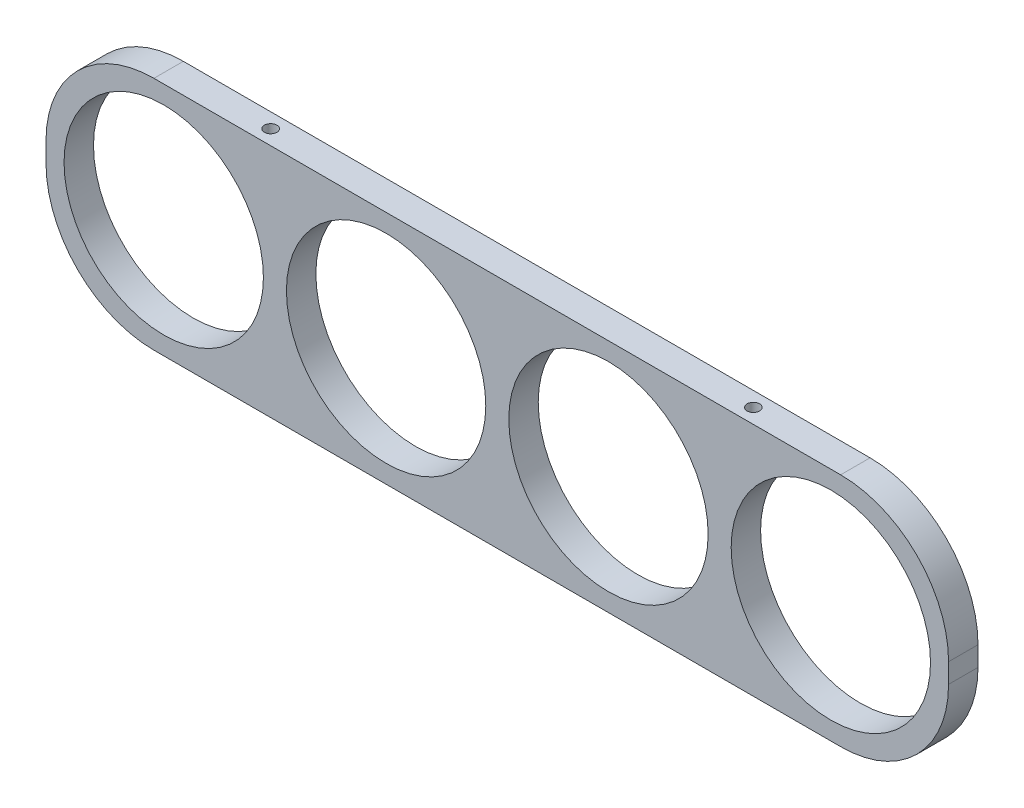
ISO-10303-21;
HEADER;
FILE_DESCRIPTION(('STEP AP214'),'2;1');
FILE_NAME('part.step','',(''),(''),'','','');
FILE_SCHEMA(('AUTOMOTIVE_DESIGN { 1 0 10303 214 1 1 1 1 }'));
ENDSEC;
DATA;
#1=APPLICATION_CONTEXT('core data for automotive mechanical design processes');
#2=APPLICATION_PROTOCOL_DEFINITION('international standard','automotive_design',2000,#1);
#3=PRODUCT_CONTEXT('',#1,'mechanical');
#4=PRODUCT('Part','Part','',(#3));
#5=PRODUCT_RELATED_PRODUCT_CATEGORY('part','',(#4));
#6=PRODUCT_DEFINITION_FORMATION('','',#4);
#7=PRODUCT_DEFINITION_CONTEXT('part definition',#1,'design');
#8=PRODUCT_DEFINITION('design','',#6,#7);
#9=PRODUCT_DEFINITION_SHAPE('','',#8);
#10=(LENGTH_UNIT() NAMED_UNIT(*) SI_UNIT(.MILLI.,.METRE.));
#11=(NAMED_UNIT(*) PLANE_ANGLE_UNIT() SI_UNIT($,.RADIAN.));
#12=(NAMED_UNIT(*) SI_UNIT($,.STERADIAN.) SOLID_ANGLE_UNIT());
#13=UNCERTAINTY_MEASURE_WITH_UNIT(LENGTH_MEASURE(1.E-05),#10,'distance_accuracy_value','');
#14=(GEOMETRIC_REPRESENTATION_CONTEXT(3) GLOBAL_UNCERTAINTY_ASSIGNED_CONTEXT((#13)) GLOBAL_UNIT_ASSIGNED_CONTEXT((#10,
#11,#12)) REPRESENTATION_CONTEXT('',''));
#15=CARTESIAN_POINT('',(0.,0.,0.));
#16=DIRECTION('',(0.,0.,1.));
#17=DIRECTION('',(1.,0.,0.));
#18=AXIS2_PLACEMENT_3D('',#15,#16,#17);
#19=CARTESIAN_POINT('',(-146.05,38.1,4.7625));
#20=DIRECTION('',(1.,0.,0.));
#21=DIRECTION('',(0.,0.,-1.));
#22=AXIS2_PLACEMENT_3D('',#19,#20,#21);
#23=PLANE('',#22);
#24=DIRECTION('',(0.,-1.,0.));
#25=VECTOR('',#24,1.);
#26=CARTESIAN_POINT('',(-146.05,38.1,4.7625));
#27=LINE('',#26,#25);
#28=CARTESIAN_POINT('',(-146.05,3.175,4.7625));
#29=VERTEX_POINT('',#28);
#30=CARTESIAN_POINT('',(-146.05,-3.17500000000001,4.7625));
#31=VERTEX_POINT('',#30);
#32=EDGE_CURVE('E164',#29,#31,#27,.T.);
#33=ORIENTED_EDGE('',*,*,#32,.F.);
#34=DIRECTION('',(0.,0.,-1.));
#35=VECTOR('',#34,1.);
#36=CARTESIAN_POINT('',(-146.05,3.17499999999999,4.7625));
#37=LINE('',#36,#35);
#38=CARTESIAN_POINT('',(-146.05,3.175,-4.7625));
#39=VERTEX_POINT('',#38);
#40=EDGE_CURVE('E190',#29,#39,#37,.T.);
#41=ORIENTED_EDGE('',*,*,#40,.T.);
#42=DIRECTION('',(0.,-1.,0.));
#43=VECTOR('',#42,1.);
#44=CARTESIAN_POINT('',(-146.05,38.1,-4.7625));
#45=LINE('',#44,#43);
#46=CARTESIAN_POINT('',(-146.05,-3.17500000000001,-4.7625));
#47=VERTEX_POINT('',#46);
#48=EDGE_CURVE('E140',#39,#47,#45,.T.);
#49=ORIENTED_EDGE('',*,*,#48,.T.);
#50=DIRECTION('',(0.,0.,-1.));
#51=VECTOR('',#50,1.);
#52=CARTESIAN_POINT('',(-146.05,-3.17500000000003,4.7625));
#53=LINE('',#52,#51);
#54=EDGE_CURVE('E177',#47,#31,#53,.F.);
#55=ORIENTED_EDGE('',*,*,#54,.T.);
#56=EDGE_LOOP('',(#33,#41,#49,#55));
#57=FACE_BOUND('',#56,.T.);
#58=ADVANCED_FACE('F42',(#57),#23,.F.);
#59=CARTESIAN_POINT('',(146.05,-38.1,4.7625));
#60=DIRECTION('',(0.,1.,0.));
#61=DIRECTION('',(-1.,0.,0.));
#62=AXIS2_PLACEMENT_3D('',#59,#60,#61);
#63=PLANE('',#62);
#64=DIRECTION('',(1.,0.,0.));
#65=VECTOR('',#64,1.);
#66=CARTESIAN_POINT('',(146.05,-38.1,-4.7625));
#67=LINE('',#66,#65);
#68=CARTESIAN_POINT('',(-111.125,-38.1,-4.7625));
#69=VERTEX_POINT('',#68);
#70=CARTESIAN_POINT('',(111.125,-38.1,-4.7625));
#71=VERTEX_POINT('',#70);
#72=EDGE_CURVE('E180',#69,#71,#67,.T.);
#73=ORIENTED_EDGE('',*,*,#72,.T.);
#74=DIRECTION('',(0.,0.,-1.));
#75=VECTOR('',#74,1.);
#76=CARTESIAN_POINT('',(111.125,-38.1,4.7625));
#77=LINE('',#76,#75);
#78=CARTESIAN_POINT('',(111.125,-38.1,4.7625));
#79=VERTEX_POINT('',#78);
#80=EDGE_CURVE('E11',#71,#79,#77,.F.);
#81=ORIENTED_EDGE('',*,*,#80,.T.);
#82=DIRECTION('',(1.,0.,0.));
#83=VECTOR('',#82,1.);
#84=CARTESIAN_POINT('',(146.05,-38.1,4.7625));
#85=LINE('',#84,#83);
#86=CARTESIAN_POINT('',(-111.125,-38.1,4.7625));
#87=VERTEX_POINT('',#86);
#88=EDGE_CURVE('E167',#87,#79,#85,.T.);
#89=ORIENTED_EDGE('',*,*,#88,.F.);
#90=DIRECTION('',(0.,0.,-1.));
#91=VECTOR('',#90,1.);
#92=CARTESIAN_POINT('',(-111.125,-38.1,4.7625));
#93=LINE('',#92,#91);
#94=EDGE_CURVE('E50',#87,#69,#93,.T.);
#95=ORIENTED_EDGE('',*,*,#94,.T.);
#96=EDGE_LOOP('',(#73,#81,#89,#95));
#97=FACE_BOUND('',#96,.T.);
#98=ADVANCED_FACE('F223',(#97),#63,.F.);
#99=CARTESIAN_POINT('',(146.05,38.1,4.7625));
#100=DIRECTION('',(-1.,0.,0.));
#101=DIRECTION('',(0.,0.,1.));
#102=AXIS2_PLACEMENT_3D('',#99,#100,#101);
#103=PLANE('',#102);
#104=DIRECTION('',(0.,1.,0.));
#105=VECTOR('',#104,1.);
#106=CARTESIAN_POINT('',(146.05,38.1,4.7625));
#107=LINE('',#106,#105);
#108=CARTESIAN_POINT('',(146.05,-3.17499999999999,4.7625));
#109=VERTEX_POINT('',#108);
#110=CARTESIAN_POINT('',(146.05,3.17500000000003,4.7625));
#111=VERTEX_POINT('',#110);
#112=EDGE_CURVE('E171',#109,#111,#107,.T.);
#113=ORIENTED_EDGE('',*,*,#112,.F.);
#114=DIRECTION('',(0.,0.,-1.));
#115=VECTOR('',#114,1.);
#116=CARTESIAN_POINT('',(146.05,-3.175,4.7625));
#117=LINE('',#116,#115);
#118=CARTESIAN_POINT('',(146.05,-3.17499999999999,-4.7625));
#119=VERTEX_POINT('',#118);
#120=EDGE_CURVE('E216',#109,#119,#117,.T.);
#121=ORIENTED_EDGE('',*,*,#120,.T.);
#122=DIRECTION('',(0.,1.,0.));
#123=VECTOR('',#122,1.);
#124=CARTESIAN_POINT('',(146.05,38.1,-4.7625));
#125=LINE('',#124,#123);
#126=CARTESIAN_POINT('',(146.05,3.17500000000003,-4.7625));
#127=VERTEX_POINT('',#126);
#128=EDGE_CURVE('E184',#119,#127,#125,.T.);
#129=ORIENTED_EDGE('',*,*,#128,.T.);
#130=DIRECTION('',(0.,0.,-1.));
#131=VECTOR('',#130,1.);
#132=CARTESIAN_POINT('',(146.05,3.17500000000001,4.7625));
#133=LINE('',#132,#131);
#134=EDGE_CURVE('E57',#127,#111,#133,.F.);
#135=ORIENTED_EDGE('',*,*,#134,.T.);
#136=EDGE_LOOP('',(#113,#121,#129,#135));
#137=FACE_BOUND('',#136,.T.);
#138=ADVANCED_FACE('F234',(#137),#103,.F.);
#139=CARTESIAN_POINT('',(146.05,38.1,4.7625));
#140=DIRECTION('',(0.,-1.,0.));
#141=DIRECTION('',(1.,0.,0.));
#142=AXIS2_PLACEMENT_3D('',#139,#140,#141);
#143=PLANE('',#142);
#144=CARTESIAN_POINT('',(-78.105,38.1,0.));
#145=DIRECTION('',(0.,1.,0.));
#146=DIRECTION('',(0.,0.,1.));
#147=AXIS2_PLACEMENT_3D('',#144,#145,#146);
#148=CIRCLE('',#147,2.01929999999999);
#149=CARTESIAN_POINT('',(-78.105,38.1,2.01929999999999));
#150=VERTEX_POINT('',#149);
#151=EDGE_CURVE('E124',#150,#150,#148,.T.);
#152=ORIENTED_EDGE('',*,*,#151,.F.);
#153=EDGE_LOOP('',(#152));
#154=FACE_BOUND('',#153,.T.);
#155=CARTESIAN_POINT('',(78.105,38.1,0.));
#156=DIRECTION('',(0.,1.,0.));
#157=DIRECTION('',(0.,0.,1.));
#158=AXIS2_PLACEMENT_3D('',#155,#156,#157);
#159=CIRCLE('',#158,2.01929999999999);
#160=CARTESIAN_POINT('',(78.105,38.1,2.01929999999999));
#161=VERTEX_POINT('',#160);
#162=EDGE_CURVE('E123',#161,#161,#159,.T.);
#163=ORIENTED_EDGE('',*,*,#162,.F.);
#164=EDGE_LOOP('',(#163));
#165=FACE_BOUND('',#164,.T.);
#166=DIRECTION('',(-1.,0.,0.));
#167=VECTOR('',#166,1.);
#168=CARTESIAN_POINT('',(146.05,38.1,-4.7625));
#169=LINE('',#168,#167);
#170=CARTESIAN_POINT('',(111.125,38.1,-4.7625));
#171=VERTEX_POINT('',#170);
#172=CARTESIAN_POINT('',(-111.125,38.1,-4.7625));
#173=VERTEX_POINT('',#172);
#174=EDGE_CURVE('E168',#171,#173,#169,.T.);
#175=ORIENTED_EDGE('',*,*,#174,.T.);
#176=DIRECTION('',(0.,0.,-1.));
#177=VECTOR('',#176,1.);
#178=CARTESIAN_POINT('',(-111.125,38.1,4.7625));
#179=LINE('',#178,#177);
#180=CARTESIAN_POINT('',(-111.125,38.1,4.7625));
#181=VERTEX_POINT('',#180);
#182=EDGE_CURVE('E205',#173,#181,#179,.F.);
#183=ORIENTED_EDGE('',*,*,#182,.T.);
#184=DIRECTION('',(-1.,0.,0.));
#185=VECTOR('',#184,1.);
#186=CARTESIAN_POINT('',(146.05,38.1,4.7625));
#187=LINE('',#186,#185);
#188=CARTESIAN_POINT('',(111.125,38.1,4.7625));
#189=VERTEX_POINT('',#188);
#190=EDGE_CURVE('E173',#189,#181,#187,.T.);
#191=ORIENTED_EDGE('',*,*,#190,.F.);
#192=DIRECTION('',(0.,0.,-1.));
#193=VECTOR('',#192,1.);
#194=CARTESIAN_POINT('',(111.125,38.1,4.7625));
#195=LINE('',#194,#193);
#196=EDGE_CURVE('E202',#189,#171,#195,.T.);
#197=ORIENTED_EDGE('',*,*,#196,.T.);
#198=EDGE_LOOP('',(#175,#183,#191,#197));
#199=FACE_BOUND('',#198,.T.);
#200=ADVANCED_FACE('F242',(#154,#165,#199),#143,.F.);
#201=CARTESIAN_POINT('',(0.,0.,4.7625));
#202=DIRECTION('',(0.,0.,-1.));
#203=DIRECTION('',(-1.,0.,0.));
#204=AXIS2_PLACEMENT_3D('',#201,#202,#203);
#205=PLANE('',#204);
#206=CARTESIAN_POINT('',(-107.95,0.,4.7625));
#207=DIRECTION('',(0.,0.,1.));
#208=DIRECTION('',(1.,0.,0.));
#209=AXIS2_PLACEMENT_3D('',#206,#207,#208);
#210=CIRCLE('',#209,32.258);
#211=CARTESIAN_POINT('',(-75.692,0.,4.7625));
#212=VERTEX_POINT('',#211);
#213=EDGE_CURVE('E141',#212,#212,#210,.T.);
#214=ORIENTED_EDGE('',*,*,#213,.F.);
#215=EDGE_LOOP('',(#214));
#216=FACE_BOUND('',#215,.T.);
#217=CARTESIAN_POINT('',(-35.9833333333333,0.,4.7625));
#218=DIRECTION('',(0.,0.,1.));
#219=DIRECTION('',(1.,0.,0.));
#220=AXIS2_PLACEMENT_3D('',#217,#218,#219);
#221=CIRCLE('',#220,32.258);
#222=CARTESIAN_POINT('',(-3.72533333333334,0.,4.7625));
#223=VERTEX_POINT('',#222);
#224=EDGE_CURVE('E149',#223,#223,#221,.T.);
#225=ORIENTED_EDGE('',*,*,#224,.F.);
#226=EDGE_LOOP('',(#225));
#227=FACE_BOUND('',#226,.T.);
#228=CARTESIAN_POINT('',(35.9833333333333,0.,4.7625));
#229=DIRECTION('',(0.,0.,1.));
#230=DIRECTION('',(1.,0.,0.));
#231=AXIS2_PLACEMENT_3D('',#228,#229,#230);
#232=CIRCLE('',#231,32.258);
#233=CARTESIAN_POINT('',(68.2413333333333,0.,4.7625));
#234=VERTEX_POINT('',#233);
#235=EDGE_CURVE('E156',#234,#234,#232,.T.);
#236=ORIENTED_EDGE('',*,*,#235,.F.);
#237=EDGE_LOOP('',(#236));
#238=FACE_BOUND('',#237,.T.);
#239=CARTESIAN_POINT('',(107.95,0.,4.7625));
#240=DIRECTION('',(0.,0.,1.));
#241=DIRECTION('',(1.,0.,0.));
#242=AXIS2_PLACEMENT_3D('',#239,#240,#241);
#243=CIRCLE('',#242,32.258);
#244=CARTESIAN_POINT('',(140.208,0.,4.7625));
#245=VERTEX_POINT('',#244);
#246=EDGE_CURVE('E135',#245,#245,#243,.T.);
#247=ORIENTED_EDGE('',*,*,#246,.F.);
#248=EDGE_LOOP('',(#247));
#249=FACE_BOUND('',#248,.T.);
#250=ORIENTED_EDGE('',*,*,#190,.T.);
#251=CARTESIAN_POINT('',(-111.125,3.17499999999999,4.7625));
#252=DIRECTION('',(0.,0.,-1.));
#253=DIRECTION('',(-1.,0.,0.));
#254=AXIS2_PLACEMENT_3D('',#251,#252,#253);
#255=CIRCLE('',#254,34.925);
#256=EDGE_CURVE('E213',#181,#29,#255,.F.);
#257=ORIENTED_EDGE('',*,*,#256,.T.);
#258=ORIENTED_EDGE('',*,*,#32,.T.);
#259=CARTESIAN_POINT('',(-111.125,-3.17500000000003,4.7625));
#260=DIRECTION('',(0.,0.,-1.));
#261=DIRECTION('',(-1.,0.,0.));
#262=AXIS2_PLACEMENT_3D('',#259,#260,#261);
#263=CIRCLE('',#262,34.925);
#264=EDGE_CURVE('E210',#31,#87,#263,.F.);
#265=ORIENTED_EDGE('',*,*,#264,.T.);
#266=ORIENTED_EDGE('',*,*,#88,.T.);
#267=CARTESIAN_POINT('',(111.125,-3.175,4.7625));
#268=DIRECTION('',(0.,0.,-1.));
#269=DIRECTION('',(-1.,0.,0.));
#270=AXIS2_PLACEMENT_3D('',#267,#268,#269);
#271=CIRCLE('',#270,34.925);
#272=EDGE_CURVE('E64',#79,#109,#271,.F.);
#273=ORIENTED_EDGE('',*,*,#272,.T.);
#274=ORIENTED_EDGE('',*,*,#112,.T.);
#275=CARTESIAN_POINT('',(111.125,3.17500000000001,4.7625));
#276=DIRECTION('',(0.,0.,-1.));
#277=DIRECTION('',(-1.,0.,0.));
#278=AXIS2_PLACEMENT_3D('',#275,#276,#277);
#279=CIRCLE('',#278,34.925);
#280=EDGE_CURVE('E208',#111,#189,#279,.F.);
#281=ORIENTED_EDGE('',*,*,#280,.T.);
#282=EDGE_LOOP('',(#250,#257,#258,#265,#266,#273,#274,#281));
#283=FACE_BOUND('',#282,.T.);
#284=ADVANCED_FACE('F236',(#216,#227,#238,#249,#283),#205,.F.);
#285=CARTESIAN_POINT('',(0.,0.,-4.7625));
#286=DIRECTION('',(0.,0.,-1.));
#287=DIRECTION('',(-1.,0.,0.));
#288=AXIS2_PLACEMENT_3D('',#285,#286,#287);
#289=PLANE('',#288);
#290=CARTESIAN_POINT('',(-107.95,0.,-4.7625));
#291=DIRECTION('',(0.,0.,1.));
#292=DIRECTION('',(1.,0.,0.));
#293=AXIS2_PLACEMENT_3D('',#290,#291,#292);
#294=CIRCLE('',#293,32.258);
#295=CARTESIAN_POINT('',(-75.692,0.,-4.7625));
#296=VERTEX_POINT('',#295);
#297=EDGE_CURVE('E136',#296,#296,#294,.T.);
#298=ORIENTED_EDGE('',*,*,#297,.T.);
#299=EDGE_LOOP('',(#298));
#300=FACE_BOUND('',#299,.T.);
#301=CARTESIAN_POINT('',(-35.9833333333333,0.,-4.7625));
#302=DIRECTION('',(0.,0.,1.));
#303=DIRECTION('',(1.,0.,0.));
#304=AXIS2_PLACEMENT_3D('',#301,#302,#303);
#305=CIRCLE('',#304,32.258);
#306=CARTESIAN_POINT('',(-3.72533333333334,0.,-4.7625));
#307=VERTEX_POINT('',#306);
#308=EDGE_CURVE('E145',#307,#307,#305,.T.);
#309=ORIENTED_EDGE('',*,*,#308,.T.);
#310=EDGE_LOOP('',(#309));
#311=FACE_BOUND('',#310,.T.);
#312=CARTESIAN_POINT('',(35.9833333333333,0.,-4.7625));
#313=DIRECTION('',(0.,0.,1.));
#314=DIRECTION('',(1.,0.,0.));
#315=AXIS2_PLACEMENT_3D('',#312,#313,#314);
#316=CIRCLE('',#315,32.258);
#317=CARTESIAN_POINT('',(68.2413333333333,0.,-4.7625));
#318=VERTEX_POINT('',#317);
#319=EDGE_CURVE('E153',#318,#318,#316,.T.);
#320=ORIENTED_EDGE('',*,*,#319,.T.);
#321=EDGE_LOOP('',(#320));
#322=FACE_BOUND('',#321,.T.);
#323=CARTESIAN_POINT('',(107.95,0.,-4.7625));
#324=DIRECTION('',(0.,0.,1.));
#325=DIRECTION('',(1.,0.,0.));
#326=AXIS2_PLACEMENT_3D('',#323,#324,#325);
#327=CIRCLE('',#326,32.258);
#328=CARTESIAN_POINT('',(140.208,0.,-4.7625));
#329=VERTEX_POINT('',#328);
#330=EDGE_CURVE('E159',#329,#329,#327,.T.);
#331=ORIENTED_EDGE('',*,*,#330,.T.);
#332=EDGE_LOOP('',(#331));
#333=FACE_BOUND('',#332,.T.);
#334=ORIENTED_EDGE('',*,*,#48,.F.);
#335=CARTESIAN_POINT('',(-111.125,3.17499999999999,-4.7625));
#336=DIRECTION('',(0.,0.,-1.));
#337=DIRECTION('',(-1.,0.,0.));
#338=AXIS2_PLACEMENT_3D('',#335,#336,#337);
#339=CIRCLE('',#338,34.925);
#340=EDGE_CURVE('E199',#39,#173,#339,.T.);
#341=ORIENTED_EDGE('',*,*,#340,.T.);
#342=ORIENTED_EDGE('',*,*,#174,.F.);
#343=CARTESIAN_POINT('',(111.125,3.17500000000001,-4.7625));
#344=DIRECTION('',(0.,0.,-1.));
#345=DIRECTION('',(-1.,0.,0.));
#346=AXIS2_PLACEMENT_3D('',#343,#344,#345);
#347=CIRCLE('',#346,34.925);
#348=EDGE_CURVE('E193',#171,#127,#347,.T.);
#349=ORIENTED_EDGE('',*,*,#348,.T.);
#350=ORIENTED_EDGE('',*,*,#128,.F.);
#351=CARTESIAN_POINT('',(111.125,-3.175,-4.7625));
#352=DIRECTION('',(0.,0.,-1.));
#353=DIRECTION('',(-1.,0.,0.));
#354=AXIS2_PLACEMENT_3D('',#351,#352,#353);
#355=CIRCLE('',#354,34.925);
#356=EDGE_CURVE('E197',#119,#71,#355,.T.);
#357=ORIENTED_EDGE('',*,*,#356,.T.);
#358=ORIENTED_EDGE('',*,*,#72,.F.);
#359=CARTESIAN_POINT('',(-111.125,-3.17500000000003,-4.7625));
#360=DIRECTION('',(0.,0.,-1.));
#361=DIRECTION('',(-1.,0.,0.));
#362=AXIS2_PLACEMENT_3D('',#359,#360,#361);
#363=CIRCLE('',#362,34.925);
#364=EDGE_CURVE('E195',#69,#47,#363,.T.);
#365=ORIENTED_EDGE('',*,*,#364,.T.);
#366=EDGE_LOOP('',(#334,#341,#342,#349,#350,#357,#358,#365));
#367=FACE_BOUND('',#366,.T.);
#368=ADVANCED_FACE('F229',(#300,#311,#322,#333,#367),#289,.T.);
#369=CARTESIAN_POINT('',(107.95,0.,-4.7625));
#370=DIRECTION('',(0.,0.,1.));
#371=DIRECTION('',(1.,0.,0.));
#372=AXIS2_PLACEMENT_3D('',#369,#370,#371);
#373=CYLINDRICAL_SURFACE('',#372,32.258);
#374=ORIENTED_EDGE('',*,*,#330,.F.);
#375=EDGE_LOOP('',(#374));
#376=FACE_BOUND('',#375,.T.);
#377=ORIENTED_EDGE('',*,*,#246,.T.);
#378=EDGE_LOOP('',(#377));
#379=FACE_BOUND('',#378,.T.);
#380=ADVANCED_FACE('F288',(#376,#379),#373,.F.);
#381=CARTESIAN_POINT('',(35.9833333333333,0.,-4.7625));
#382=DIRECTION('',(0.,0.,1.));
#383=DIRECTION('',(1.,0.,0.));
#384=AXIS2_PLACEMENT_3D('',#381,#382,#383);
#385=CYLINDRICAL_SURFACE('',#384,32.258);
#386=ORIENTED_EDGE('',*,*,#319,.F.);
#387=EDGE_LOOP('',(#386));
#388=FACE_BOUND('',#387,.T.);
#389=ORIENTED_EDGE('',*,*,#235,.T.);
#390=EDGE_LOOP('',(#389));
#391=FACE_BOUND('',#390,.T.);
#392=ADVANCED_FACE('F278',(#388,#391),#385,.F.);
#393=CARTESIAN_POINT('',(-35.9833333333333,0.,-4.7625));
#394=DIRECTION('',(0.,0.,1.));
#395=DIRECTION('',(1.,0.,0.));
#396=AXIS2_PLACEMENT_3D('',#393,#394,#395);
#397=CYLINDRICAL_SURFACE('',#396,32.258);
#398=ORIENTED_EDGE('',*,*,#308,.F.);
#399=EDGE_LOOP('',(#398));
#400=FACE_BOUND('',#399,.T.);
#401=ORIENTED_EDGE('',*,*,#224,.T.);
#402=EDGE_LOOP('',(#401));
#403=FACE_BOUND('',#402,.T.);
#404=ADVANCED_FACE('F272',(#400,#403),#397,.F.);
#405=CARTESIAN_POINT('',(-107.95,0.,-4.7625));
#406=DIRECTION('',(0.,0.,1.));
#407=DIRECTION('',(1.,0.,0.));
#408=AXIS2_PLACEMENT_3D('',#405,#406,#407);
#409=CYLINDRICAL_SURFACE('',#408,32.258);
#410=ORIENTED_EDGE('',*,*,#297,.F.);
#411=EDGE_LOOP('',(#410));
#412=FACE_BOUND('',#411,.T.);
#413=ORIENTED_EDGE('',*,*,#213,.T.);
#414=EDGE_LOOP('',(#413));
#415=FACE_BOUND('',#414,.T.);
#416=ADVANCED_FACE('F268',(#412,#415),#409,.F.);
#417=CARTESIAN_POINT('',(-111.125,3.17499999999999,4.7625));
#418=DIRECTION('',(0.,0.,-1.));
#419=DIRECTION('',(-1.,0.,0.));
#420=AXIS2_PLACEMENT_3D('',#417,#418,#419);
#421=CYLINDRICAL_SURFACE('',#420,34.925);
#422=ORIENTED_EDGE('',*,*,#256,.F.);
#423=ORIENTED_EDGE('',*,*,#182,.F.);
#424=ORIENTED_EDGE('',*,*,#340,.F.);
#425=ORIENTED_EDGE('',*,*,#40,.F.);
#426=EDGE_LOOP('',(#422,#423,#424,#425));
#427=FACE_BOUND('',#426,.T.);
#428=ADVANCED_FACE('F247',(#427),#421,.T.);
#429=CARTESIAN_POINT('',(111.125,-3.175,4.7625));
#430=DIRECTION('',(0.,0.,-1.));
#431=DIRECTION('',(-1.,0.,0.));
#432=AXIS2_PLACEMENT_3D('',#429,#430,#431);
#433=CYLINDRICAL_SURFACE('',#432,34.925);
#434=ORIENTED_EDGE('',*,*,#272,.F.);
#435=ORIENTED_EDGE('',*,*,#80,.F.);
#436=ORIENTED_EDGE('',*,*,#356,.F.);
#437=ORIENTED_EDGE('',*,*,#120,.F.);
#438=EDGE_LOOP('',(#434,#435,#436,#437));
#439=FACE_BOUND('',#438,.T.);
#440=ADVANCED_FACE('F233',(#439),#433,.T.);
#441=CARTESIAN_POINT('',(-111.125,-3.17500000000003,4.7625));
#442=DIRECTION('',(0.,0.,-1.));
#443=DIRECTION('',(-1.,0.,0.));
#444=AXIS2_PLACEMENT_3D('',#441,#442,#443);
#445=CYLINDRICAL_SURFACE('',#444,34.925);
#446=ORIENTED_EDGE('',*,*,#264,.F.);
#447=ORIENTED_EDGE('',*,*,#54,.F.);
#448=ORIENTED_EDGE('',*,*,#364,.F.);
#449=ORIENTED_EDGE('',*,*,#94,.F.);
#450=EDGE_LOOP('',(#446,#447,#448,#449));
#451=FACE_BOUND('',#450,.T.);
#452=ADVANCED_FACE('F251',(#451),#445,.T.);
#453=CARTESIAN_POINT('',(111.125,3.17500000000001,4.7625));
#454=DIRECTION('',(0.,0.,-1.));
#455=DIRECTION('',(-1.,0.,0.));
#456=AXIS2_PLACEMENT_3D('',#453,#454,#455);
#457=CYLINDRICAL_SURFACE('',#456,34.925);
#458=ORIENTED_EDGE('',*,*,#280,.F.);
#459=ORIENTED_EDGE('',*,*,#134,.F.);
#460=ORIENTED_EDGE('',*,*,#348,.F.);
#461=ORIENTED_EDGE('',*,*,#196,.F.);
#462=EDGE_LOOP('',(#458,#459,#460,#461));
#463=FACE_BOUND('',#462,.T.);
#464=ADVANCED_FACE('F44',(#463),#457,.T.);
#465=CARTESIAN_POINT('',(78.105,19.05,0.));
#466=DIRECTION('',(0.,1.,0.));
#467=DIRECTION('',(0.,0.,1.));
#468=AXIS2_PLACEMENT_3D('',#465,#466,#467);
#469=CONICAL_SURFACE('',#468,2.01929999999999,1.02974425867665);
#470=CARTESIAN_POINT('',(78.105,17.8366821519976,0.));
#471=VERTEX_POINT('',#470);
#472=VERTEX_LOOP('',#471);
#473=FACE_BOUND('',#472,.T.);
#474=CARTESIAN_POINT('',(78.105,19.05,0.));
#475=DIRECTION('',(0.,1.,0.));
#476=DIRECTION('',(0.,0.,1.));
#477=AXIS2_PLACEMENT_3D('',#474,#475,#476);
#478=CIRCLE('',#477,2.01929999999999);
#479=CARTESIAN_POINT('',(78.105,19.05,2.01929999999999));
#480=VERTEX_POINT('',#479);
#481=EDGE_CURVE('E127',#480,#480,#478,.T.);
#482=ORIENTED_EDGE('',*,*,#481,.T.);
#483=EDGE_LOOP('',(#482));
#484=FACE_BOUND('',#483,.T.);
#485=ADVANCED_FACE('F257',(#473,#484),#469,.F.);
#486=CARTESIAN_POINT('',(78.105,38.1,0.));
#487=DIRECTION('',(0.,1.,0.));
#488=DIRECTION('',(0.,0.,1.));
#489=AXIS2_PLACEMENT_3D('',#486,#487,#488);
#490=CYLINDRICAL_SURFACE('',#489,2.01929999999999);
#491=ORIENTED_EDGE('',*,*,#481,.F.);
#492=EDGE_LOOP('',(#491));
#493=FACE_BOUND('',#492,.T.);
#494=ORIENTED_EDGE('',*,*,#162,.T.);
#495=EDGE_LOOP('',(#494));
#496=FACE_BOUND('',#495,.T.);
#497=ADVANCED_FACE('F117',(#493,#496),#490,.F.);
#498=CARTESIAN_POINT('',(-78.105,19.05,0.));
#499=DIRECTION('',(0.,1.,0.));
#500=DIRECTION('',(0.,0.,1.));
#501=AXIS2_PLACEMENT_3D('',#498,#499,#500);
#502=CONICAL_SURFACE('',#501,2.01929999999999,1.02974425867665);
#503=CARTESIAN_POINT('',(-78.105,17.8366821519976,0.));
#504=VERTEX_POINT('',#503);
#505=VERTEX_LOOP('',#504);
#506=FACE_BOUND('',#505,.T.);
#507=CARTESIAN_POINT('',(-78.105,19.05,0.));
#508=DIRECTION('',(0.,1.,0.));
#509=DIRECTION('',(0.,0.,1.));
#510=AXIS2_PLACEMENT_3D('',#507,#508,#509);
#511=CIRCLE('',#510,2.01929999999999);
#512=CARTESIAN_POINT('',(-78.105,19.05,2.01929999999999));
#513=VERTEX_POINT('',#512);
#514=EDGE_CURVE('E121',#513,#513,#511,.T.);
#515=ORIENTED_EDGE('',*,*,#514,.T.);
#516=EDGE_LOOP('',(#515));
#517=FACE_BOUND('',#516,.T.);
#518=ADVANCED_FACE('F113',(#506,#517),#502,.F.);
#519=CARTESIAN_POINT('',(-78.105,38.1,0.));
#520=DIRECTION('',(0.,1.,0.));
#521=DIRECTION('',(0.,0.,1.));
#522=AXIS2_PLACEMENT_3D('',#519,#520,#521);
#523=CYLINDRICAL_SURFACE('',#522,2.01929999999999);
#524=ORIENTED_EDGE('',*,*,#514,.F.);
#525=EDGE_LOOP('',(#524));
#526=FACE_BOUND('',#525,.T.);
#527=ORIENTED_EDGE('',*,*,#151,.T.);
#528=EDGE_LOOP('',(#527));
#529=FACE_BOUND('',#528,.T.);
#530=ADVANCED_FACE('F116',(#526,#529),#523,.F.);
#531=CLOSED_SHELL('',(#58,#98,#138,#200,#284,#368,#380,#392,#404,#416,#428,#440,#452,#464,#485,
#497,#518,#530));
#532=MANIFOLD_SOLID_BREP('B2',#531);
#533=ADVANCED_BREP_SHAPE_REPRESENTATION('',(#18,#532),#14);
#534=SHAPE_DEFINITION_REPRESENTATION(#9,#533);
ENDSEC;
END-ISO-10303-21;
